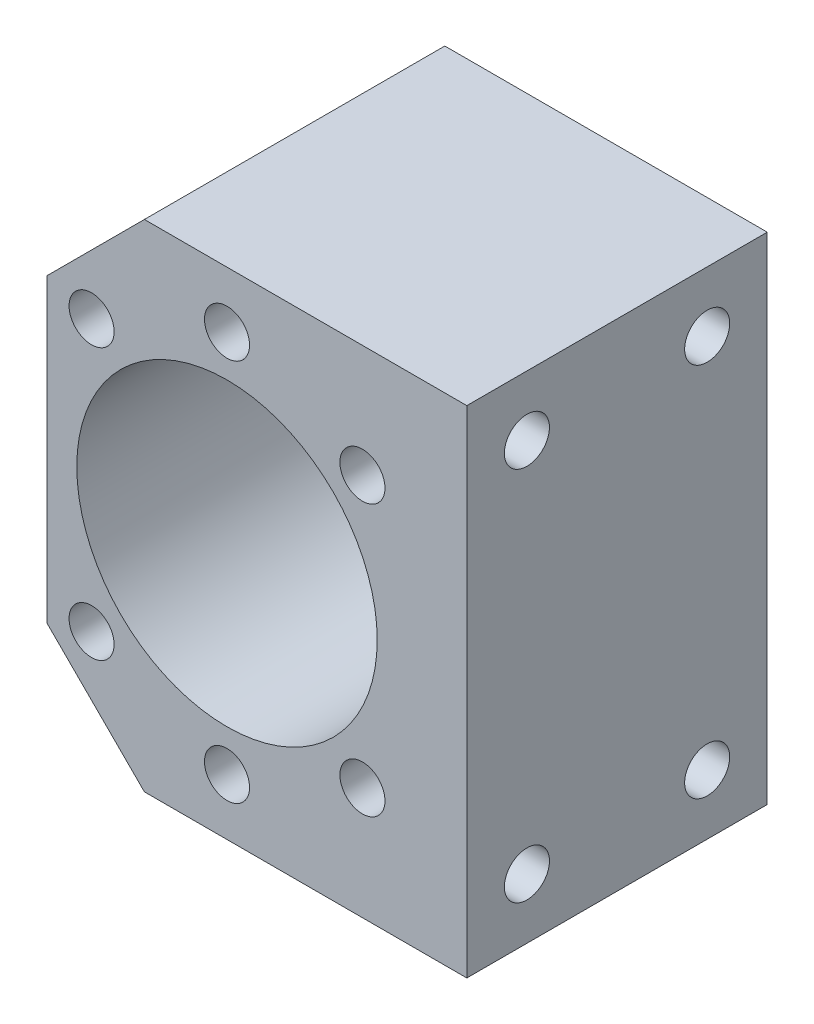
ISO-10303-21;
HEADER;
FILE_DESCRIPTION(('STEP AP214'),'2;1');
FILE_NAME('part.step','',(''),(''),'','','');
FILE_SCHEMA(('AUTOMOTIVE_DESIGN { 1 0 10303 214 1 1 1 1 }'));
ENDSEC;
DATA;
#1=APPLICATION_CONTEXT('core data for automotive mechanical design processes');
#2=APPLICATION_PROTOCOL_DEFINITION('international standard','automotive_design',2000,#1);
#3=PRODUCT_CONTEXT('',#1,'mechanical');
#4=PRODUCT('Part','Part','',(#3));
#5=PRODUCT_RELATED_PRODUCT_CATEGORY('part','',(#4));
#6=PRODUCT_DEFINITION_FORMATION('','',#4);
#7=PRODUCT_DEFINITION_CONTEXT('part definition',#1,'design');
#8=PRODUCT_DEFINITION('design','',#6,#7);
#9=PRODUCT_DEFINITION_SHAPE('','',#8);
#10=(LENGTH_UNIT() NAMED_UNIT(*) SI_UNIT(.MILLI.,.METRE.));
#11=(NAMED_UNIT(*) PLANE_ANGLE_UNIT() SI_UNIT($,.RADIAN.));
#12=(NAMED_UNIT(*) SI_UNIT($,.STERADIAN.) SOLID_ANGLE_UNIT());
#13=UNCERTAINTY_MEASURE_WITH_UNIT(LENGTH_MEASURE(1.E-05),#10,'distance_accuracy_value','');
#14=(GEOMETRIC_REPRESENTATION_CONTEXT(3) GLOBAL_UNCERTAINTY_ASSIGNED_CONTEXT((#13)) GLOBAL_UNIT_ASSIGNED_CONTEXT((#10,
#11,#12)) REPRESENTATION_CONTEXT('',''));
#15=CARTESIAN_POINT('',(0.,0.,0.));
#16=DIRECTION('',(0.,0.,1.));
#17=DIRECTION('',(1.,0.,0.));
#18=AXIS2_PLACEMENT_3D('',#15,#16,#17);
#19=CARTESIAN_POINT('',(0.,0.,40.));
#20=DIRECTION('',(0.,0.,1.));
#21=DIRECTION('',(1.,0.,0.));
#22=AXIS2_PLACEMENT_3D('',#19,#20,#21);
#23=PLANE('',#22);
#24=CARTESIAN_POINT('',(0.,25.5,40.));
#25=DIRECTION('',(0.,0.,1.));
#26=DIRECTION('',(1.,0.,0.));
#27=AXIS2_PLACEMENT_3D('',#24,#25,#26);
#28=CIRCLE('',#27,3.);
#29=CARTESIAN_POINT('',(3.,25.5,40.));
#30=VERTEX_POINT('',#29);
#31=EDGE_CURVE('E304',#30,#30,#28,.T.);
#32=ORIENTED_EDGE('',*,*,#31,.F.);
#33=EDGE_LOOP('',(#32));
#34=FACE_BOUND('',#33,.T.);
#35=CARTESIAN_POINT('',(-18.031222920257,18.031222920257,40.));
#36=DIRECTION('',(0.,0.,1.));
#37=DIRECTION('',(1.,0.,0.));
#38=AXIS2_PLACEMENT_3D('',#35,#36,#37);
#39=CIRCLE('',#38,3.);
#40=CARTESIAN_POINT('',(-15.031222920257,18.031222920257,40.));
#41=VERTEX_POINT('',#40);
#42=EDGE_CURVE('E298',#41,#41,#39,.T.);
#43=ORIENTED_EDGE('',*,*,#42,.F.);
#44=EDGE_LOOP('',(#43));
#45=FACE_BOUND('',#44,.T.);
#46=CARTESIAN_POINT('',(-18.031222920257,-18.031222920257,40.));
#47=DIRECTION('',(0.,0.,1.));
#48=DIRECTION('',(1.,0.,0.));
#49=AXIS2_PLACEMENT_3D('',#46,#47,#48);
#50=CIRCLE('',#49,3.);
#51=CARTESIAN_POINT('',(-15.031222920257,-18.031222920257,40.));
#52=VERTEX_POINT('',#51);
#53=EDGE_CURVE('E311',#52,#52,#50,.T.);
#54=ORIENTED_EDGE('',*,*,#53,.F.);
#55=EDGE_LOOP('',(#54));
#56=FACE_BOUND('',#55,.T.);
#57=CARTESIAN_POINT('',(0.,-25.5,40.));
#58=DIRECTION('',(0.,0.,1.));
#59=DIRECTION('',(1.,0.,0.));
#60=AXIS2_PLACEMENT_3D('',#57,#58,#59);
#61=CIRCLE('',#60,3.);
#62=CARTESIAN_POINT('',(3.,-25.5,40.));
#63=VERTEX_POINT('',#62);
#64=EDGE_CURVE('E328',#63,#63,#61,.T.);
#65=ORIENTED_EDGE('',*,*,#64,.F.);
#66=EDGE_LOOP('',(#65));
#67=FACE_BOUND('',#66,.T.);
#68=CARTESIAN_POINT('',(18.031222920257,-18.031222920257,40.));
#69=DIRECTION('',(0.,0.,1.));
#70=DIRECTION('',(1.,0.,0.));
#71=AXIS2_PLACEMENT_3D('',#68,#69,#70);
#72=CIRCLE('',#71,3.);
#73=CARTESIAN_POINT('',(21.031222920257,-18.031222920257,40.));
#74=VERTEX_POINT('',#73);
#75=EDGE_CURVE('E322',#74,#74,#72,.T.);
#76=ORIENTED_EDGE('',*,*,#75,.F.);
#77=EDGE_LOOP('',(#76));
#78=FACE_BOUND('',#77,.T.);
#79=CARTESIAN_POINT('',(18.031222920257,18.031222920257,40.));
#80=DIRECTION('',(0.,0.,1.));
#81=DIRECTION('',(1.,0.,0.));
#82=AXIS2_PLACEMENT_3D('',#79,#80,#81);
#83=CIRCLE('',#82,3.);
#84=CARTESIAN_POINT('',(21.031222920257,18.031222920257,40.));
#85=VERTEX_POINT('',#84);
#86=EDGE_CURVE('E316',#85,#85,#83,.T.);
#87=ORIENTED_EDGE('',*,*,#86,.F.);
#88=EDGE_LOOP('',(#87));
#89=FACE_BOUND('',#88,.T.);
#90=DIRECTION('',(0.707106781186548,-0.707106781186547,0.));
#91=VECTOR('',#90,1.);
#92=CARTESIAN_POINT('',(-24.,-20.,40.));
#93=LINE('',#92,#91);
#94=CARTESIAN_POINT('',(-24.,-20.,40.));
#95=VERTEX_POINT('',#94);
#96=CARTESIAN_POINT('',(-11.,-33.,40.));
#97=VERTEX_POINT('',#96);
#98=EDGE_CURVE('E161',#95,#97,#93,.T.);
#99=ORIENTED_EDGE('',*,*,#98,.T.);
#100=DIRECTION('',(1.,0.,0.));
#101=VECTOR('',#100,1.);
#102=CARTESIAN_POINT('',(-11.,-33.,40.));
#103=LINE('',#102,#101);
#104=CARTESIAN_POINT('',(31.93,-33.,40.));
#105=VERTEX_POINT('',#104);
#106=EDGE_CURVE('E111',#97,#105,#103,.T.);
#107=ORIENTED_EDGE('',*,*,#106,.T.);
#108=DIRECTION('',(0.,1.,0.));
#109=VECTOR('',#108,1.);
#110=CARTESIAN_POINT('',(31.93,-33.,40.));
#111=LINE('',#110,#109);
#112=CARTESIAN_POINT('',(31.93,33.,40.));
#113=VERTEX_POINT('',#112);
#114=EDGE_CURVE('E138',#105,#113,#111,.T.);
#115=ORIENTED_EDGE('',*,*,#114,.T.);
#116=DIRECTION('',(1.,0.,0.));
#117=VECTOR('',#116,1.);
#118=CARTESIAN_POINT('',(-11.,33.,40.));
#119=LINE('',#118,#117);
#120=CARTESIAN_POINT('',(-11.,33.,40.));
#121=VERTEX_POINT('',#120);
#122=EDGE_CURVE('E124',#121,#113,#119,.T.);
#123=ORIENTED_EDGE('',*,*,#122,.F.);
#124=DIRECTION('',(0.707106781186548,0.707106781186547,0.));
#125=VECTOR('',#124,1.);
#126=CARTESIAN_POINT('',(-24.,20.,40.));
#127=LINE('',#126,#125);
#128=CARTESIAN_POINT('',(-24.,20.,40.));
#129=VERTEX_POINT('',#128);
#130=EDGE_CURVE('E136',#129,#121,#127,.T.);
#131=ORIENTED_EDGE('',*,*,#130,.F.);
#132=DIRECTION('',(0.,1.,0.));
#133=VECTOR('',#132,1.);
#134=CARTESIAN_POINT('',(-24.,-20.,40.));
#135=LINE('',#134,#133);
#136=EDGE_CURVE('E142',#95,#129,#135,.T.);
#137=ORIENTED_EDGE('',*,*,#136,.F.);
#138=EDGE_LOOP('',(#99,#107,#115,#123,#131,#137));
#139=FACE_BOUND('',#138,.T.);
#140=CARTESIAN_POINT('',(0.,0.,40.));
#141=DIRECTION('',(0.,0.,1.));
#142=DIRECTION('',(1.,0.,0.));
#143=AXIS2_PLACEMENT_3D('',#140,#141,#142);
#144=CIRCLE('',#143,20.);
#145=CARTESIAN_POINT('',(20.,0.,40.));
#146=VERTEX_POINT('',#145);
#147=EDGE_CURVE('E150',#146,#146,#144,.T.);
#148=ORIENTED_EDGE('',*,*,#147,.F.);
#149=EDGE_LOOP('',(#148));
#150=FACE_BOUND('',#149,.T.);
#151=ADVANCED_FACE('F62',(#34,#45,#56,#67,#78,#89,#139,#150),#23,.T.);
#152=CARTESIAN_POINT('',(0.,0.,0.));
#153=DIRECTION('',(0.,0.,1.));
#154=DIRECTION('',(1.,0.,0.));
#155=AXIS2_PLACEMENT_3D('',#152,#153,#154);
#156=PLANE('',#155);
#157=DIRECTION('',(0.707106781186548,-0.707106781186547,0.));
#158=VECTOR('',#157,1.);
#159=CARTESIAN_POINT('',(-24.,-20.,0.));
#160=LINE('',#159,#158);
#161=CARTESIAN_POINT('',(-24.,-20.,0.));
#162=VERTEX_POINT('',#161);
#163=CARTESIAN_POINT('',(-11.,-33.,0.));
#164=VERTEX_POINT('',#163);
#165=EDGE_CURVE('E147',#162,#164,#160,.T.);
#166=ORIENTED_EDGE('',*,*,#165,.F.);
#167=DIRECTION('',(0.,1.,0.));
#168=VECTOR('',#167,1.);
#169=CARTESIAN_POINT('',(-24.,-20.,0.));
#170=LINE('',#169,#168);
#171=CARTESIAN_POINT('',(-24.,20.,0.));
#172=VERTEX_POINT('',#171);
#173=EDGE_CURVE('E158',#162,#172,#170,.T.);
#174=ORIENTED_EDGE('',*,*,#173,.T.);
#175=DIRECTION('',(0.707106781186548,0.707106781186547,0.));
#176=VECTOR('',#175,1.);
#177=CARTESIAN_POINT('',(-24.,20.,0.));
#178=LINE('',#177,#176);
#179=CARTESIAN_POINT('',(-11.,33.,0.));
#180=VERTEX_POINT('',#179);
#181=EDGE_CURVE('E156',#172,#180,#178,.T.);
#182=ORIENTED_EDGE('',*,*,#181,.T.);
#183=DIRECTION('',(1.,0.,0.));
#184=VECTOR('',#183,1.);
#185=CARTESIAN_POINT('',(-11.,33.,0.));
#186=LINE('',#185,#184);
#187=CARTESIAN_POINT('',(31.93,33.,0.));
#188=VERTEX_POINT('',#187);
#189=EDGE_CURVE('E126',#180,#188,#186,.T.);
#190=ORIENTED_EDGE('',*,*,#189,.T.);
#191=DIRECTION('',(0.,1.,0.));
#192=VECTOR('',#191,1.);
#193=CARTESIAN_POINT('',(31.93,-33.,0.));
#194=LINE('',#193,#192);
#195=CARTESIAN_POINT('',(31.93,-33.,0.));
#196=VERTEX_POINT('',#195);
#197=EDGE_CURVE('E152',#196,#188,#194,.T.);
#198=ORIENTED_EDGE('',*,*,#197,.F.);
#199=DIRECTION('',(1.,0.,0.));
#200=VECTOR('',#199,1.);
#201=CARTESIAN_POINT('',(-11.,-33.,0.));
#202=LINE('',#201,#200);
#203=EDGE_CURVE('E149',#164,#196,#202,.T.);
#204=ORIENTED_EDGE('',*,*,#203,.F.);
#205=EDGE_LOOP('',(#166,#174,#182,#190,#198,#204));
#206=FACE_BOUND('',#205,.T.);
#207=CARTESIAN_POINT('',(0.,0.,0.));
#208=DIRECTION('',(0.,0.,1.));
#209=DIRECTION('',(1.,0.,0.));
#210=AXIS2_PLACEMENT_3D('',#207,#208,#209);
#211=CIRCLE('',#210,20.);
#212=CARTESIAN_POINT('',(20.,0.,0.));
#213=VERTEX_POINT('',#212);
#214=EDGE_CURVE('E303',#213,#213,#211,.T.);
#215=ORIENTED_EDGE('',*,*,#214,.T.);
#216=EDGE_LOOP('',(#215));
#217=FACE_BOUND('',#216,.T.);
#218=ADVANCED_FACE('F169',(#206,#217),#156,.F.);
#219=CARTESIAN_POINT('',(-24.,-20.,40.));
#220=DIRECTION('',(0.707106781186547,0.707106781186548,0.));
#221=DIRECTION('',(-0.707106781186548,0.707106781186547,0.));
#222=AXIS2_PLACEMENT_3D('',#219,#220,#221);
#223=PLANE('',#222);
#224=ORIENTED_EDGE('',*,*,#165,.T.);
#225=DIRECTION('',(0.,0.,-1.));
#226=VECTOR('',#225,1.);
#227=CARTESIAN_POINT('',(-11.,-33.,40.));
#228=LINE('',#227,#226);
#229=EDGE_CURVE('E12',#97,#164,#228,.T.);
#230=ORIENTED_EDGE('',*,*,#229,.F.);
#231=ORIENTED_EDGE('',*,*,#98,.F.);
#232=DIRECTION('',(0.,0.,-1.));
#233=VECTOR('',#232,1.);
#234=CARTESIAN_POINT('',(-24.,-20.,40.));
#235=LINE('',#234,#233);
#236=EDGE_CURVE('E79',#95,#162,#235,.T.);
#237=ORIENTED_EDGE('',*,*,#236,.T.);
#238=EDGE_LOOP('',(#224,#230,#231,#237));
#239=FACE_BOUND('',#238,.T.);
#240=ADVANCED_FACE('F64',(#239),#223,.F.);
#241=CARTESIAN_POINT('',(-11.,-33.,40.));
#242=DIRECTION('',(0.,1.,0.));
#243=DIRECTION('',(0.,0.,1.));
#244=AXIS2_PLACEMENT_3D('',#241,#242,#243);
#245=PLANE('',#244);
#246=ORIENTED_EDGE('',*,*,#203,.T.);
#247=DIRECTION('',(0.,0.,-1.));
#248=VECTOR('',#247,1.);
#249=CARTESIAN_POINT('',(31.93,-33.,40.));
#250=LINE('',#249,#248);
#251=EDGE_CURVE('E71',#105,#196,#250,.T.);
#252=ORIENTED_EDGE('',*,*,#251,.F.);
#253=ORIENTED_EDGE('',*,*,#106,.F.);
#254=ORIENTED_EDGE('',*,*,#229,.T.);
#255=EDGE_LOOP('',(#246,#252,#253,#254));
#256=FACE_BOUND('',#255,.T.);
#257=ADVANCED_FACE('F342',(#256),#245,.F.);
#258=CARTESIAN_POINT('',(31.93,-33.,40.));
#259=DIRECTION('',(-1.,0.,0.));
#260=DIRECTION('',(0.,0.,1.));
#261=AXIS2_PLACEMENT_3D('',#258,#259,#260);
#262=PLANE('',#261);
#263=CARTESIAN_POINT('',(31.93,-25.,32.));
#264=DIRECTION('',(1.,0.,0.));
#265=DIRECTION('',(0.,0.,-1.));
#266=AXIS2_PLACEMENT_3D('',#263,#264,#265);
#267=CIRCLE('',#266,3.);
#268=CARTESIAN_POINT('',(31.93,-25.,29.));
#269=VERTEX_POINT('',#268);
#270=EDGE_CURVE('E294',#269,#269,#267,.T.);
#271=ORIENTED_EDGE('',*,*,#270,.F.);
#272=EDGE_LOOP('',(#271));
#273=FACE_BOUND('',#272,.T.);
#274=CARTESIAN_POINT('',(31.93,-25.,8.));
#275=DIRECTION('',(1.,0.,0.));
#276=DIRECTION('',(0.,0.,-1.));
#277=AXIS2_PLACEMENT_3D('',#274,#275,#276);
#278=CIRCLE('',#277,3.);
#279=CARTESIAN_POINT('',(31.93,-25.,5.));
#280=VERTEX_POINT('',#279);
#281=EDGE_CURVE('E288',#280,#280,#278,.T.);
#282=ORIENTED_EDGE('',*,*,#281,.F.);
#283=EDGE_LOOP('',(#282));
#284=FACE_BOUND('',#283,.T.);
#285=CARTESIAN_POINT('',(31.93,25.,8.));
#286=DIRECTION('',(1.,0.,0.));
#287=DIRECTION('',(0.,0.,-1.));
#288=AXIS2_PLACEMENT_3D('',#285,#286,#287);
#289=CIRCLE('',#288,3.);
#290=CARTESIAN_POINT('',(31.93,25.,5.));
#291=VERTEX_POINT('',#290);
#292=EDGE_CURVE('E277',#291,#291,#289,.T.);
#293=ORIENTED_EDGE('',*,*,#292,.F.);
#294=EDGE_LOOP('',(#293));
#295=FACE_BOUND('',#294,.T.);
#296=CARTESIAN_POINT('',(31.93,25.,32.));
#297=DIRECTION('',(1.,0.,0.));
#298=DIRECTION('',(0.,0.,-1.));
#299=AXIS2_PLACEMENT_3D('',#296,#297,#298);
#300=CIRCLE('',#299,3.);
#301=CARTESIAN_POINT('',(31.93,25.,29.));
#302=VERTEX_POINT('',#301);
#303=EDGE_CURVE('E276',#302,#302,#300,.T.);
#304=ORIENTED_EDGE('',*,*,#303,.F.);
#305=EDGE_LOOP('',(#304));
#306=FACE_BOUND('',#305,.T.);
#307=ORIENTED_EDGE('',*,*,#197,.T.);
#308=DIRECTION('',(0.,0.,-1.));
#309=VECTOR('',#308,1.);
#310=CARTESIAN_POINT('',(31.93,33.,40.));
#311=LINE('',#310,#309);
#312=EDGE_CURVE('E130',#113,#188,#311,.T.);
#313=ORIENTED_EDGE('',*,*,#312,.F.);
#314=ORIENTED_EDGE('',*,*,#114,.F.);
#315=ORIENTED_EDGE('',*,*,#251,.T.);
#316=EDGE_LOOP('',(#307,#313,#314,#315));
#317=FACE_BOUND('',#316,.T.);
#318=ADVANCED_FACE('F167',(#273,#284,#295,#306,#317),#262,.F.);
#319=CARTESIAN_POINT('',(-11.,33.,40.));
#320=DIRECTION('',(0.,1.,0.));
#321=DIRECTION('',(0.,0.,1.));
#322=AXIS2_PLACEMENT_3D('',#319,#320,#321);
#323=PLANE('',#322);
#324=ORIENTED_EDGE('',*,*,#189,.F.);
#325=DIRECTION('',(0.,0.,-1.));
#326=VECTOR('',#325,1.);
#327=CARTESIAN_POINT('',(-11.,33.,40.));
#328=LINE('',#327,#326);
#329=EDGE_CURVE('E121',#121,#180,#328,.T.);
#330=ORIENTED_EDGE('',*,*,#329,.F.);
#331=ORIENTED_EDGE('',*,*,#122,.T.);
#332=ORIENTED_EDGE('',*,*,#312,.T.);
#333=EDGE_LOOP('',(#324,#330,#331,#332));
#334=FACE_BOUND('',#333,.T.);
#335=ADVANCED_FACE('F123',(#334),#323,.T.);
#336=CARTESIAN_POINT('',(-24.,20.,40.));
#337=DIRECTION('',(-0.707106781186547,0.707106781186548,0.));
#338=DIRECTION('',(-0.707106781186548,-0.707106781186547,0.));
#339=AXIS2_PLACEMENT_3D('',#336,#337,#338);
#340=PLANE('',#339);
#341=ORIENTED_EDGE('',*,*,#181,.F.);
#342=DIRECTION('',(0.,0.,-1.));
#343=VECTOR('',#342,1.);
#344=CARTESIAN_POINT('',(-24.,20.,40.));
#345=LINE('',#344,#343);
#346=EDGE_CURVE('E99',#129,#172,#345,.T.);
#347=ORIENTED_EDGE('',*,*,#346,.F.);
#348=ORIENTED_EDGE('',*,*,#130,.T.);
#349=ORIENTED_EDGE('',*,*,#329,.T.);
#350=EDGE_LOOP('',(#341,#347,#348,#349));
#351=FACE_BOUND('',#350,.T.);
#352=ADVANCED_FACE('F141',(#351),#340,.T.);
#353=CARTESIAN_POINT('',(-24.,-20.,40.));
#354=DIRECTION('',(-1.,0.,0.));
#355=DIRECTION('',(0.,0.,1.));
#356=AXIS2_PLACEMENT_3D('',#353,#354,#355);
#357=PLANE('',#356);
#358=ORIENTED_EDGE('',*,*,#173,.F.);
#359=ORIENTED_EDGE('',*,*,#236,.F.);
#360=ORIENTED_EDGE('',*,*,#136,.T.);
#361=ORIENTED_EDGE('',*,*,#346,.T.);
#362=EDGE_LOOP('',(#358,#359,#360,#361));
#363=FACE_BOUND('',#362,.T.);
#364=ADVANCED_FACE('F171',(#363),#357,.T.);
#365=CARTESIAN_POINT('',(0.,0.,40.));
#366=DIRECTION('',(0.,0.,-1.));
#367=DIRECTION('',(-1.,0.,0.));
#368=AXIS2_PLACEMENT_3D('',#365,#366,#367);
#369=CYLINDRICAL_SURFACE('',#368,20.);
#370=ORIENTED_EDGE('',*,*,#147,.T.);
#371=EDGE_LOOP('',(#370));
#372=FACE_BOUND('',#371,.T.);
#373=ORIENTED_EDGE('',*,*,#214,.F.);
#374=EDGE_LOOP('',(#373));
#375=FACE_BOUND('',#374,.T.);
#376=ADVANCED_FACE('F173',(#372,#375),#369,.F.);
#377=CARTESIAN_POINT('',(18.031222920257,18.031222920257,24.));
#378=DIRECTION('',(0.,0.,1.));
#379=DIRECTION('',(1.,0.,0.));
#380=AXIS2_PLACEMENT_3D('',#377,#378,#379);
#381=CYLINDRICAL_SURFACE('',#380,3.);
#382=CARTESIAN_POINT('',(18.031222920257,18.031222920257,24.));
#383=DIRECTION('',(0.,0.,1.));
#384=DIRECTION('',(1.,0.,0.));
#385=AXIS2_PLACEMENT_3D('',#382,#383,#384);
#386=CIRCLE('',#385,3.);
#387=CARTESIAN_POINT('',(21.031222920257,18.031222920257,24.));
#388=VERTEX_POINT('',#387);
#389=EDGE_CURVE('E307',#388,#388,#386,.T.);
#390=ORIENTED_EDGE('',*,*,#389,.F.);
#391=EDGE_LOOP('',(#390));
#392=FACE_BOUND('',#391,.T.);
#393=ORIENTED_EDGE('',*,*,#86,.T.);
#394=EDGE_LOOP('',(#393));
#395=FACE_BOUND('',#394,.T.);
#396=ADVANCED_FACE('F179',(#392,#395),#381,.F.);
#397=CARTESIAN_POINT('',(18.031222920257,18.031222920257,24.));
#398=DIRECTION('',(0.,0.,1.));
#399=DIRECTION('',(1.,0.,0.));
#400=AXIS2_PLACEMENT_3D('',#397,#398,#399);
#401=PLANE('',#400);
#402=ORIENTED_EDGE('',*,*,#389,.T.);
#403=EDGE_LOOP('',(#402));
#404=FACE_BOUND('',#403,.T.);
#405=ADVANCED_FACE('F215',(#404),#401,.T.);
#406=CARTESIAN_POINT('',(18.031222920257,-18.031222920257,24.));
#407=DIRECTION('',(0.,0.,1.));
#408=DIRECTION('',(1.,0.,0.));
#409=AXIS2_PLACEMENT_3D('',#406,#407,#408);
#410=CYLINDRICAL_SURFACE('',#409,3.);
#411=CARTESIAN_POINT('',(18.031222920257,-18.031222920257,24.));
#412=DIRECTION('',(0.,0.,1.));
#413=DIRECTION('',(1.,0.,0.));
#414=AXIS2_PLACEMENT_3D('',#411,#412,#413);
#415=CIRCLE('',#414,3.);
#416=CARTESIAN_POINT('',(21.031222920257,-18.031222920257,24.));
#417=VERTEX_POINT('',#416);
#418=EDGE_CURVE('E319',#417,#417,#415,.T.);
#419=ORIENTED_EDGE('',*,*,#418,.F.);
#420=EDGE_LOOP('',(#419));
#421=FACE_BOUND('',#420,.T.);
#422=ORIENTED_EDGE('',*,*,#75,.T.);
#423=EDGE_LOOP('',(#422));
#424=FACE_BOUND('',#423,.T.);
#425=ADVANCED_FACE('F212',(#421,#424),#410,.F.);
#426=CARTESIAN_POINT('',(18.031222920257,-18.031222920257,24.));
#427=DIRECTION('',(0.,0.,1.));
#428=DIRECTION('',(1.,0.,0.));
#429=AXIS2_PLACEMENT_3D('',#426,#427,#428);
#430=PLANE('',#429);
#431=ORIENTED_EDGE('',*,*,#418,.T.);
#432=EDGE_LOOP('',(#431));
#433=FACE_BOUND('',#432,.T.);
#434=ADVANCED_FACE('F207',(#433),#430,.T.);
#435=CARTESIAN_POINT('',(0.,-25.5,24.));
#436=DIRECTION('',(0.,0.,1.));
#437=DIRECTION('',(1.,0.,0.));
#438=AXIS2_PLACEMENT_3D('',#435,#436,#437);
#439=CYLINDRICAL_SURFACE('',#438,3.);
#440=CARTESIAN_POINT('',(0.,-25.5,24.));
#441=DIRECTION('',(0.,0.,1.));
#442=DIRECTION('',(1.,0.,0.));
#443=AXIS2_PLACEMENT_3D('',#440,#441,#442);
#444=CIRCLE('',#443,3.);
#445=CARTESIAN_POINT('',(3.,-25.5,24.));
#446=VERTEX_POINT('',#445);
#447=EDGE_CURVE('E325',#446,#446,#444,.T.);
#448=ORIENTED_EDGE('',*,*,#447,.F.);
#449=EDGE_LOOP('',(#448));
#450=FACE_BOUND('',#449,.T.);
#451=ORIENTED_EDGE('',*,*,#64,.T.);
#452=EDGE_LOOP('',(#451));
#453=FACE_BOUND('',#452,.T.);
#454=ADVANCED_FACE('F204',(#450,#453),#439,.F.);
#455=CARTESIAN_POINT('',(0.,-25.5,24.));
#456=DIRECTION('',(0.,0.,1.));
#457=DIRECTION('',(1.,0.,0.));
#458=AXIS2_PLACEMENT_3D('',#455,#456,#457);
#459=PLANE('',#458);
#460=ORIENTED_EDGE('',*,*,#447,.T.);
#461=EDGE_LOOP('',(#460));
#462=FACE_BOUND('',#461,.T.);
#463=ADVANCED_FACE('F198',(#462),#459,.T.);
#464=CARTESIAN_POINT('',(-18.031222920257,-18.031222920257,24.));
#465=DIRECTION('',(0.,0.,1.));
#466=DIRECTION('',(1.,0.,0.));
#467=AXIS2_PLACEMENT_3D('',#464,#465,#466);
#468=CYLINDRICAL_SURFACE('',#467,3.);
#469=CARTESIAN_POINT('',(-18.031222920257,-18.031222920257,24.));
#470=DIRECTION('',(0.,0.,1.));
#471=DIRECTION('',(1.,0.,0.));
#472=AXIS2_PLACEMENT_3D('',#469,#470,#471);
#473=CIRCLE('',#472,3.);
#474=CARTESIAN_POINT('',(-15.031222920257,-18.031222920257,24.));
#475=VERTEX_POINT('',#474);
#476=EDGE_CURVE('E331',#475,#475,#473,.T.);
#477=ORIENTED_EDGE('',*,*,#476,.F.);
#478=EDGE_LOOP('',(#477));
#479=FACE_BOUND('',#478,.T.);
#480=ORIENTED_EDGE('',*,*,#53,.T.);
#481=EDGE_LOOP('',(#480));
#482=FACE_BOUND('',#481,.T.);
#483=ADVANCED_FACE('F194',(#479,#482),#468,.F.);
#484=CARTESIAN_POINT('',(-18.031222920257,-18.031222920257,24.));
#485=DIRECTION('',(0.,0.,1.));
#486=DIRECTION('',(1.,0.,0.));
#487=AXIS2_PLACEMENT_3D('',#484,#485,#486);
#488=PLANE('',#487);
#489=ORIENTED_EDGE('',*,*,#476,.T.);
#490=EDGE_LOOP('',(#489));
#491=FACE_BOUND('',#490,.T.);
#492=ADVANCED_FACE('F197',(#491),#488,.T.);
#493=CARTESIAN_POINT('',(-18.031222920257,18.031222920257,24.));
#494=DIRECTION('',(0.,0.,1.));
#495=DIRECTION('',(1.,0.,0.));
#496=AXIS2_PLACEMENT_3D('',#493,#494,#495);
#497=CYLINDRICAL_SURFACE('',#496,3.);
#498=CARTESIAN_POINT('',(-18.031222920257,18.031222920257,24.));
#499=DIRECTION('',(0.,0.,1.));
#500=DIRECTION('',(1.,0.,0.));
#501=AXIS2_PLACEMENT_3D('',#498,#499,#500);
#502=CIRCLE('',#501,3.);
#503=CARTESIAN_POINT('',(-15.031222920257,18.031222920257,24.));
#504=VERTEX_POINT('',#503);
#505=EDGE_CURVE('E308',#504,#504,#502,.T.);
#506=ORIENTED_EDGE('',*,*,#505,.F.);
#507=EDGE_LOOP('',(#506));
#508=FACE_BOUND('',#507,.T.);
#509=ORIENTED_EDGE('',*,*,#42,.T.);
#510=EDGE_LOOP('',(#509));
#511=FACE_BOUND('',#510,.T.);
#512=ADVANCED_FACE('F202',(#508,#511),#497,.F.);
#513=CARTESIAN_POINT('',(-18.031222920257,18.031222920257,24.));
#514=DIRECTION('',(0.,0.,1.));
#515=DIRECTION('',(1.,0.,0.));
#516=AXIS2_PLACEMENT_3D('',#513,#514,#515);
#517=PLANE('',#516);
#518=ORIENTED_EDGE('',*,*,#505,.T.);
#519=EDGE_LOOP('',(#518));
#520=FACE_BOUND('',#519,.T.);
#521=ADVANCED_FACE('F227',(#520),#517,.T.);
#522=CARTESIAN_POINT('',(0.,25.5,24.));
#523=DIRECTION('',(0.,0.,1.));
#524=DIRECTION('',(1.,0.,0.));
#525=AXIS2_PLACEMENT_3D('',#522,#523,#524);
#526=CYLINDRICAL_SURFACE('',#525,3.);
#527=CARTESIAN_POINT('',(0.,25.5,24.));
#528=DIRECTION('',(0.,0.,1.));
#529=DIRECTION('',(1.,0.,0.));
#530=AXIS2_PLACEMENT_3D('',#527,#528,#529);
#531=CIRCLE('',#530,3.);
#532=CARTESIAN_POINT('',(3.,25.5,24.));
#533=VERTEX_POINT('',#532);
#534=EDGE_CURVE('E300',#533,#533,#531,.T.);
#535=ORIENTED_EDGE('',*,*,#534,.F.);
#536=EDGE_LOOP('',(#535));
#537=FACE_BOUND('',#536,.T.);
#538=ORIENTED_EDGE('',*,*,#31,.T.);
#539=EDGE_LOOP('',(#538));
#540=FACE_BOUND('',#539,.T.);
#541=ADVANCED_FACE('F231',(#537,#540),#526,.F.);
#542=CARTESIAN_POINT('',(0.,25.5,24.));
#543=DIRECTION('',(0.,0.,1.));
#544=DIRECTION('',(1.,0.,0.));
#545=AXIS2_PLACEMENT_3D('',#542,#543,#544);
#546=PLANE('',#545);
#547=ORIENTED_EDGE('',*,*,#534,.T.);
#548=EDGE_LOOP('',(#547));
#549=FACE_BOUND('',#548,.T.);
#550=ADVANCED_FACE('F235',(#549),#546,.T.);
#551=CARTESIAN_POINT('',(15.93,25.,32.));
#552=DIRECTION('',(1.,0.,0.));
#553=DIRECTION('',(0.,0.,-1.));
#554=AXIS2_PLACEMENT_3D('',#551,#552,#553);
#555=CYLINDRICAL_SURFACE('',#554,3.);
#556=CARTESIAN_POINT('',(15.93,25.,32.));
#557=DIRECTION('',(1.,0.,0.));
#558=DIRECTION('',(0.,0.,-1.));
#559=AXIS2_PLACEMENT_3D('',#556,#557,#558);
#560=CIRCLE('',#559,3.);
#561=CARTESIAN_POINT('',(15.93,25.,29.));
#562=VERTEX_POINT('',#561);
#563=EDGE_CURVE('E280',#562,#562,#560,.T.);
#564=ORIENTED_EDGE('',*,*,#563,.F.);
#565=EDGE_LOOP('',(#564));
#566=FACE_BOUND('',#565,.T.);
#567=ORIENTED_EDGE('',*,*,#303,.T.);
#568=EDGE_LOOP('',(#567));
#569=FACE_BOUND('',#568,.T.);
#570=ADVANCED_FACE('F239',(#566,#569),#555,.F.);
#571=CARTESIAN_POINT('',(15.93,25.,32.));
#572=DIRECTION('',(1.,0.,0.));
#573=DIRECTION('',(0.,0.,-1.));
#574=AXIS2_PLACEMENT_3D('',#571,#572,#573);
#575=PLANE('',#574);
#576=ORIENTED_EDGE('',*,*,#563,.T.);
#577=EDGE_LOOP('',(#576));
#578=FACE_BOUND('',#577,.T.);
#579=ADVANCED_FACE('F243',(#578),#575,.T.);
#580=CARTESIAN_POINT('',(15.93,25.,8.));
#581=DIRECTION('',(1.,0.,0.));
#582=DIRECTION('',(0.,0.,-1.));
#583=AXIS2_PLACEMENT_3D('',#580,#581,#582);
#584=CYLINDRICAL_SURFACE('',#583,3.);
#585=CARTESIAN_POINT('',(15.93,25.,8.));
#586=DIRECTION('',(1.,0.,0.));
#587=DIRECTION('',(0.,0.,-1.));
#588=AXIS2_PLACEMENT_3D('',#585,#586,#587);
#589=CIRCLE('',#588,3.);
#590=CARTESIAN_POINT('',(15.93,25.,5.));
#591=VERTEX_POINT('',#590);
#592=EDGE_CURVE('E275',#591,#591,#589,.T.);
#593=ORIENTED_EDGE('',*,*,#592,.F.);
#594=EDGE_LOOP('',(#593));
#595=FACE_BOUND('',#594,.T.);
#596=ORIENTED_EDGE('',*,*,#292,.T.);
#597=EDGE_LOOP('',(#596));
#598=FACE_BOUND('',#597,.T.);
#599=ADVANCED_FACE('F247',(#595,#598),#584,.F.);
#600=CARTESIAN_POINT('',(15.93,25.,8.));
#601=DIRECTION('',(1.,0.,0.));
#602=DIRECTION('',(0.,0.,-1.));
#603=AXIS2_PLACEMENT_3D('',#600,#601,#602);
#604=PLANE('',#603);
#605=ORIENTED_EDGE('',*,*,#592,.T.);
#606=EDGE_LOOP('',(#605));
#607=FACE_BOUND('',#606,.T.);
#608=ADVANCED_FACE('F261',(#607),#604,.T.);
#609=CARTESIAN_POINT('',(15.93,-25.,8.));
#610=DIRECTION('',(1.,0.,0.));
#611=DIRECTION('',(0.,0.,-1.));
#612=AXIS2_PLACEMENT_3D('',#609,#610,#611);
#613=CYLINDRICAL_SURFACE('',#612,3.);
#614=CARTESIAN_POINT('',(15.93,-25.,8.));
#615=DIRECTION('',(1.,0.,0.));
#616=DIRECTION('',(0.,0.,-1.));
#617=AXIS2_PLACEMENT_3D('',#614,#615,#616);
#618=CIRCLE('',#617,3.);
#619=CARTESIAN_POINT('',(15.93,-25.,5.));
#620=VERTEX_POINT('',#619);
#621=EDGE_CURVE('E283',#620,#620,#618,.T.);
#622=ORIENTED_EDGE('',*,*,#621,.F.);
#623=EDGE_LOOP('',(#622));
#624=FACE_BOUND('',#623,.T.);
#625=ORIENTED_EDGE('',*,*,#281,.T.);
#626=EDGE_LOOP('',(#625));
#627=FACE_BOUND('',#626,.T.);
#628=ADVANCED_FACE('F258',(#624,#627),#613,.F.);
#629=CARTESIAN_POINT('',(15.93,-25.,8.));
#630=DIRECTION('',(1.,0.,0.));
#631=DIRECTION('',(0.,0.,-1.));
#632=AXIS2_PLACEMENT_3D('',#629,#630,#631);
#633=PLANE('',#632);
#634=ORIENTED_EDGE('',*,*,#621,.T.);
#635=EDGE_LOOP('',(#634));
#636=FACE_BOUND('',#635,.T.);
#637=ADVANCED_FACE('F253',(#636),#633,.T.);
#638=CARTESIAN_POINT('',(15.93,-25.,32.));
#639=DIRECTION('',(1.,0.,0.));
#640=DIRECTION('',(0.,0.,-1.));
#641=AXIS2_PLACEMENT_3D('',#638,#639,#640);
#642=CYLINDRICAL_SURFACE('',#641,3.);
#643=CARTESIAN_POINT('',(15.93,-25.,32.));
#644=DIRECTION('',(1.,0.,0.));
#645=DIRECTION('',(0.,0.,-1.));
#646=AXIS2_PLACEMENT_3D('',#643,#644,#645);
#647=CIRCLE('',#646,3.);
#648=CARTESIAN_POINT('',(15.93,-25.,29.));
#649=VERTEX_POINT('',#648);
#650=EDGE_CURVE('E291',#649,#649,#647,.T.);
#651=ORIENTED_EDGE('',*,*,#650,.F.);
#652=EDGE_LOOP('',(#651));
#653=FACE_BOUND('',#652,.T.);
#654=ORIENTED_EDGE('',*,*,#270,.T.);
#655=EDGE_LOOP('',(#654));
#656=FACE_BOUND('',#655,.T.);
#657=ADVANCED_FACE('F249',(#653,#656),#642,.F.);
#658=CARTESIAN_POINT('',(15.93,-25.,32.));
#659=DIRECTION('',(1.,0.,0.));
#660=DIRECTION('',(0.,0.,-1.));
#661=AXIS2_PLACEMENT_3D('',#658,#659,#660);
#662=PLANE('',#661);
#663=ORIENTED_EDGE('',*,*,#650,.T.);
#664=EDGE_LOOP('',(#663));
#665=FACE_BOUND('',#664,.T.);
#666=ADVANCED_FACE('F252',(#665),#662,.T.);
#667=CLOSED_SHELL('',(#151,#218,#240,#257,#318,#335,#352,#364,#376,#396,#405,#425,#434,#454,
#463,#483,#492,#512,#521,#541,#550,#570,#579,#599,#608,#628,#637,#657,#666));
#668=MANIFOLD_SOLID_BREP('B2',#667);
#669=ADVANCED_BREP_SHAPE_REPRESENTATION('',(#18,#668),#14);
#670=SHAPE_DEFINITION_REPRESENTATION(#9,#669);
ENDSEC;
END-ISO-10303-21;
